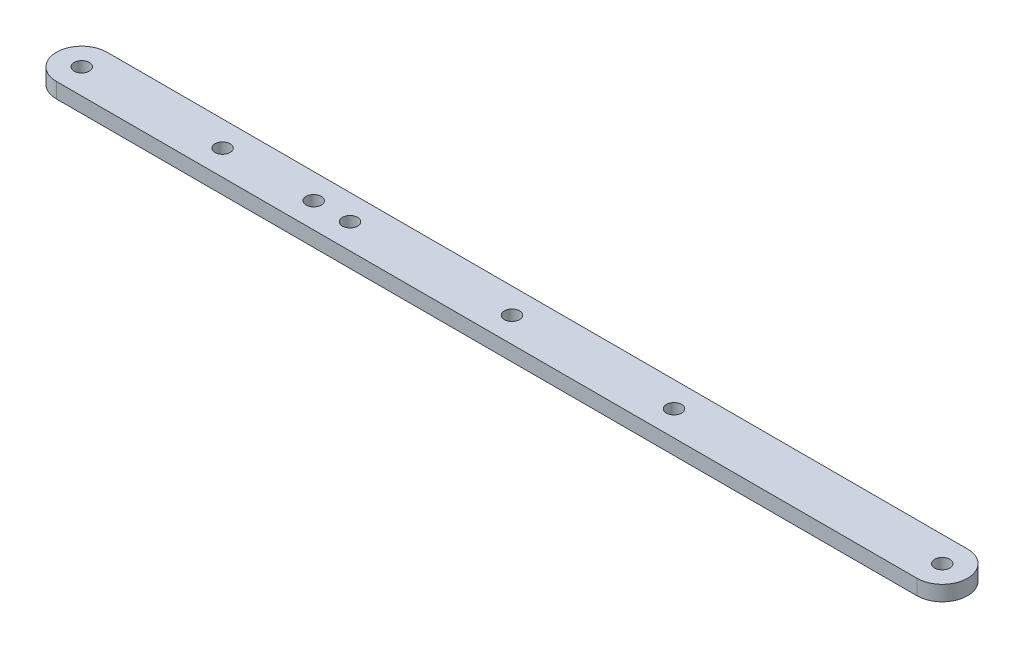
ISO-10303-21;
HEADER;
FILE_DESCRIPTION(('STEP AP214'),'2;1');
FILE_NAME('part.step','',(''),(''),'','','');
FILE_SCHEMA(('AUTOMOTIVE_DESIGN { 1 0 10303 214 1 1 1 1 }'));
ENDSEC;
DATA;
#1=APPLICATION_CONTEXT('core data for automotive mechanical design processes');
#2=APPLICATION_PROTOCOL_DEFINITION('international standard','automotive_design',2000,#1);
#3=PRODUCT_CONTEXT('',#1,'mechanical');
#4=PRODUCT('Part','Part','',(#3));
#5=PRODUCT_RELATED_PRODUCT_CATEGORY('part','',(#4));
#6=PRODUCT_DEFINITION_FORMATION('','',#4);
#7=PRODUCT_DEFINITION_CONTEXT('part definition',#1,'design');
#8=PRODUCT_DEFINITION('design','',#6,#7);
#9=PRODUCT_DEFINITION_SHAPE('','',#8);
#10=(LENGTH_UNIT() NAMED_UNIT(*) SI_UNIT(.MILLI.,.METRE.));
#11=(NAMED_UNIT(*) PLANE_ANGLE_UNIT() SI_UNIT($,.RADIAN.));
#12=(NAMED_UNIT(*) SI_UNIT($,.STERADIAN.) SOLID_ANGLE_UNIT());
#13=UNCERTAINTY_MEASURE_WITH_UNIT(LENGTH_MEASURE(1.E-05),#10,'distance_accuracy_value','');
#14=(GEOMETRIC_REPRESENTATION_CONTEXT(3) GLOBAL_UNCERTAINTY_ASSIGNED_CONTEXT((#13)) GLOBAL_UNIT_ASSIGNED_CONTEXT((#10,
#11,#12)) REPRESENTATION_CONTEXT('',''));
#15=CARTESIAN_POINT('',(0.,0.,0.));
#16=DIRECTION('',(0.,0.,1.));
#17=DIRECTION('',(1.,0.,0.));
#18=AXIS2_PLACEMENT_3D('',#15,#16,#17);
#19=CARTESIAN_POINT('',(-5.00000000000003,0.,-5.00000000000002));
#20=DIRECTION('',(0.,-1.,0.));
#21=DIRECTION('',(0.,0.,-1.));
#22=AXIS2_PLACEMENT_3D('',#19,#20,#21);
#23=CYLINDRICAL_SURFACE('',#22,5.00000000000002);
#24=DIRECTION('',(0.,-1.,0.));
#25=VECTOR('',#24,1.);
#26=CARTESIAN_POINT('',(-5.00000000000003,3.,0.));
#27=LINE('',#26,#25);
#28=CARTESIAN_POINT('',(-5.00000000000003,0.,0.));
#29=VERTEX_POINT('',#28);
#30=CARTESIAN_POINT('',(-5.00000000000003,3.,0.));
#31=VERTEX_POINT('',#30);
#32=EDGE_CURVE('E85',#29,#31,#27,.F.);
#33=ORIENTED_EDGE('',*,*,#32,.F.);
#34=CARTESIAN_POINT('',(-5.00000000000003,0.,-5.00000000000002));
#35=DIRECTION('',(0.,1.,0.));
#36=DIRECTION('',(0.,0.,1.));
#37=AXIS2_PLACEMENT_3D('',#34,#35,#36);
#38=CIRCLE('',#37,5.00000000000002);
#39=CARTESIAN_POINT('',(-5.00000000000001,0.,-10.));
#40=VERTEX_POINT('',#39);
#41=EDGE_CURVE('E43',#40,#29,#38,.F.);
#42=ORIENTED_EDGE('',*,*,#41,.F.);
#43=DIRECTION('',(0.,-1.,0.));
#44=VECTOR('',#43,1.);
#45=CARTESIAN_POINT('',(-5.00000000000003,3.,-10.));
#46=LINE('',#45,#44);
#47=CARTESIAN_POINT('',(-5.00000000000001,3.,-10.));
#48=VERTEX_POINT('',#47);
#49=EDGE_CURVE('E108',#48,#40,#46,.T.);
#50=ORIENTED_EDGE('',*,*,#49,.F.);
#51=CARTESIAN_POINT('',(-5.00000000000003,3.,-5.00000000000002));
#52=DIRECTION('',(0.,1.,0.));
#53=DIRECTION('',(0.,0.,1.));
#54=AXIS2_PLACEMENT_3D('',#51,#52,#53);
#55=CIRCLE('',#54,5.00000000000002);
#56=EDGE_CURVE('E11',#31,#48,#55,.T.);
#57=ORIENTED_EDGE('',*,*,#56,.F.);
#58=EDGE_LOOP('',(#33,#42,#50,#57));
#59=FACE_BOUND('',#58,.T.);
#60=ADVANCED_FACE('F35',(#59),#23,.T.);
#61=CARTESIAN_POINT('',(-175.,3.,-5.00000000000002));
#62=DIRECTION('',(0.,-1.,0.));
#63=DIRECTION('',(0.,0.,-1.));
#64=AXIS2_PLACEMENT_3D('',#61,#62,#63);
#65=CYLINDRICAL_SURFACE('',#64,5.);
#66=DIRECTION('',(0.,-1.,0.));
#67=VECTOR('',#66,1.);
#68=CARTESIAN_POINT('',(-175.,3.,0.));
#69=LINE('',#68,#67);
#70=CARTESIAN_POINT('',(-175.,3.,0.));
#71=VERTEX_POINT('',#70);
#72=CARTESIAN_POINT('',(-175.,0.,0.));
#73=VERTEX_POINT('',#72);
#74=EDGE_CURVE('E78',#71,#73,#69,.T.);
#75=ORIENTED_EDGE('',*,*,#74,.F.);
#76=CARTESIAN_POINT('',(-175.,3.,-5.00000000000002));
#77=DIRECTION('',(0.,1.,0.));
#78=DIRECTION('',(0.,0.,1.));
#79=AXIS2_PLACEMENT_3D('',#76,#77,#78);
#80=CIRCLE('',#79,5.);
#81=CARTESIAN_POINT('',(-175.,3.,-10.));
#82=VERTEX_POINT('',#81);
#83=EDGE_CURVE('E86',#82,#71,#80,.T.);
#84=ORIENTED_EDGE('',*,*,#83,.F.);
#85=DIRECTION('',(0.,-1.,0.));
#86=VECTOR('',#85,1.);
#87=CARTESIAN_POINT('',(-175.,3.,-10.));
#88=LINE('',#87,#86);
#89=CARTESIAN_POINT('',(-175.,0.,-10.));
#90=VERTEX_POINT('',#89);
#91=EDGE_CURVE('E81',#90,#82,#88,.F.);
#92=ORIENTED_EDGE('',*,*,#91,.F.);
#93=CARTESIAN_POINT('',(-175.,0.,-5.00000000000002));
#94=DIRECTION('',(0.,1.,0.));
#95=DIRECTION('',(0.,0.,1.));
#96=AXIS2_PLACEMENT_3D('',#93,#94,#95);
#97=CIRCLE('',#96,5.);
#98=EDGE_CURVE('E74',#73,#90,#97,.F.);
#99=ORIENTED_EDGE('',*,*,#98,.F.);
#100=EDGE_LOOP('',(#75,#84,#92,#99));
#101=FACE_BOUND('',#100,.T.);
#102=ADVANCED_FACE('F76',(#101),#65,.T.);
#103=CARTESIAN_POINT('',(0.,3.,0.));
#104=DIRECTION('',(0.,1.,0.));
#105=DIRECTION('',(0.,0.,1.));
#106=AXIS2_PLACEMENT_3D('',#103,#104,#105);
#107=PLANE('',#106);
#108=CARTESIAN_POINT('',(-147.18268,3.,-5.00000000000001));
#109=DIRECTION('',(0.,1.,0.));
#110=DIRECTION('',(0.,0.,1.));
#111=AXIS2_PLACEMENT_3D('',#108,#109,#110);
#112=CIRCLE('',#111,1.5);
#113=CARTESIAN_POINT('',(-147.18268,3.,-3.50000000000001));
#114=VERTEX_POINT('',#113);
#115=EDGE_CURVE('E151',#114,#114,#112,.T.);
#116=ORIENTED_EDGE('',*,*,#115,.F.);
#117=EDGE_LOOP('',(#116));
#118=FACE_BOUND('',#117,.T.);
#119=CARTESIAN_POINT('',(-129.18268,3.,-5.00000000000001));
#120=DIRECTION('',(0.,1.,0.));
#121=DIRECTION('',(0.,0.,-1.));
#122=AXIS2_PLACEMENT_3D('',#119,#120,#121);
#123=CIRCLE('',#122,1.5);
#124=CARTESIAN_POINT('',(-129.18268,3.,-6.50000000000001));
#125=VERTEX_POINT('',#124);
#126=EDGE_CURVE('E145',#125,#125,#123,.T.);
#127=ORIENTED_EDGE('',*,*,#126,.F.);
#128=EDGE_LOOP('',(#127));
#129=FACE_BOUND('',#128,.T.);
#130=CARTESIAN_POINT('',(-58.,3.,-5.00000000000002));
#131=DIRECTION('',(0.,1.,0.));
#132=DIRECTION('',(0.,0.,1.));
#133=AXIS2_PLACEMENT_3D('',#130,#131,#132);
#134=CIRCLE('',#133,1.5);
#135=CARTESIAN_POINT('',(-58.,3.,-3.50000000000002));
#136=VERTEX_POINT('',#135);
#137=EDGE_CURVE('E130',#136,#136,#134,.T.);
#138=ORIENTED_EDGE('',*,*,#137,.F.);
#139=EDGE_LOOP('',(#138));
#140=FACE_BOUND('',#139,.T.);
#141=CARTESIAN_POINT('',(-5.,3.,-5.));
#142=DIRECTION('',(0.,1.,0.));
#143=DIRECTION('',(0.,0.,-1.));
#144=AXIS2_PLACEMENT_3D('',#141,#142,#143);
#145=CIRCLE('',#144,1.5);
#146=CARTESIAN_POINT('',(-5.,3.,-6.5));
#147=VERTEX_POINT('',#146);
#148=EDGE_CURVE('E118',#147,#147,#145,.T.);
#149=ORIENTED_EDGE('',*,*,#148,.F.);
#150=EDGE_LOOP('',(#149));
#151=FACE_BOUND('',#150,.T.);
#152=DIRECTION('',(1.,0.,0.));
#153=VECTOR('',#152,1.);
#154=CARTESIAN_POINT('',(0.,3.,0.));
#155=LINE('',#154,#153);
#156=EDGE_CURVE('E93',#71,#31,#155,.T.);
#157=ORIENTED_EDGE('',*,*,#156,.T.);
#158=ORIENTED_EDGE('',*,*,#56,.T.);
#159=DIRECTION('',(-1.,0.,0.));
#160=VECTOR('',#159,1.);
#161=CARTESIAN_POINT('',(0.,3.,-10.));
#162=LINE('',#161,#160);
#163=EDGE_CURVE('E97',#48,#82,#162,.T.);
#164=ORIENTED_EDGE('',*,*,#163,.T.);
#165=ORIENTED_EDGE('',*,*,#83,.T.);
#166=EDGE_LOOP('',(#157,#158,#164,#165));
#167=FACE_BOUND('',#166,.T.);
#168=CARTESIAN_POINT('',(-175.,3.,-5.00000000000002));
#169=DIRECTION('',(0.,1.,0.));
#170=DIRECTION('',(0.,0.,1.));
#171=AXIS2_PLACEMENT_3D('',#168,#169,#170);
#172=CIRCLE('',#171,1.5);
#173=CARTESIAN_POINT('',(-175.,3.,-3.50000000000003));
#174=VERTEX_POINT('',#173);
#175=EDGE_CURVE('E101',#174,#174,#172,.T.);
#176=ORIENTED_EDGE('',*,*,#175,.F.);
#177=EDGE_LOOP('',(#176));
#178=FACE_BOUND('',#177,.T.);
#179=CARTESIAN_POINT('',(-90.,3.,-5.00000000000002));
#180=DIRECTION('',(0.,1.,0.));
#181=DIRECTION('',(0.,0.,1.));
#182=AXIS2_PLACEMENT_3D('',#179,#180,#181);
#183=CIRCLE('',#182,1.5);
#184=CARTESIAN_POINT('',(-90.,3.,-3.50000000000003));
#185=VERTEX_POINT('',#184);
#186=EDGE_CURVE('E124',#185,#185,#183,.T.);
#187=ORIENTED_EDGE('',*,*,#186,.F.);
#188=EDGE_LOOP('',(#187));
#189=FACE_BOUND('',#188,.T.);
#190=CARTESIAN_POINT('',(-122.,3.,-5.00000000000002));
#191=DIRECTION('',(0.,1.,0.));
#192=DIRECTION('',(0.,0.,-1.));
#193=AXIS2_PLACEMENT_3D('',#190,#191,#192);
#194=CIRCLE('',#193,1.50000000000001);
#195=CARTESIAN_POINT('',(-122.,3.,-6.50000000000003));
#196=VERTEX_POINT('',#195);
#197=EDGE_CURVE('E136',#196,#196,#194,.T.);
#198=ORIENTED_EDGE('',*,*,#197,.F.);
#199=EDGE_LOOP('',(#198));
#200=FACE_BOUND('',#199,.T.);
#201=ADVANCED_FACE('F112',(#118,#129,#140,#151,#167,#178,#189,#200),#107,.T.);
#202=CARTESIAN_POINT('',(0.,0.,0.));
#203=DIRECTION('',(0.,1.,0.));
#204=DIRECTION('',(0.,0.,1.));
#205=AXIS2_PLACEMENT_3D('',#202,#203,#204);
#206=PLANE('',#205);
#207=CARTESIAN_POINT('',(-147.18268,0.,-5.00000000000001));
#208=DIRECTION('',(0.,1.,0.));
#209=DIRECTION('',(0.,0.,1.));
#210=AXIS2_PLACEMENT_3D('',#207,#208,#209);
#211=CIRCLE('',#210,1.5);
#212=CARTESIAN_POINT('',(-147.18268,0.,-3.50000000000001));
#213=VERTEX_POINT('',#212);
#214=EDGE_CURVE('E142',#213,#213,#211,.T.);
#215=ORIENTED_EDGE('',*,*,#214,.T.);
#216=EDGE_LOOP('',(#215));
#217=FACE_BOUND('',#216,.T.);
#218=CARTESIAN_POINT('',(-129.18268,0.,-5.00000000000001));
#219=DIRECTION('',(0.,1.,0.));
#220=DIRECTION('',(0.,0.,-1.));
#221=AXIS2_PLACEMENT_3D('',#218,#219,#220);
#222=CIRCLE('',#221,1.5);
#223=CARTESIAN_POINT('',(-129.18268,0.,-6.50000000000001));
#224=VERTEX_POINT('',#223);
#225=EDGE_CURVE('E148',#224,#224,#222,.T.);
#226=ORIENTED_EDGE('',*,*,#225,.T.);
#227=EDGE_LOOP('',(#226));
#228=FACE_BOUND('',#227,.T.);
#229=DIRECTION('',(-1.,0.,0.));
#230=VECTOR('',#229,1.);
#231=CARTESIAN_POINT('',(0.,0.,-10.));
#232=LINE('',#231,#230);
#233=EDGE_CURVE('E98',#40,#90,#232,.T.);
#234=ORIENTED_EDGE('',*,*,#233,.F.);
#235=ORIENTED_EDGE('',*,*,#41,.T.);
#236=DIRECTION('',(1.,0.,0.));
#237=VECTOR('',#236,1.);
#238=CARTESIAN_POINT('',(0.,0.,0.));
#239=LINE('',#238,#237);
#240=EDGE_CURVE('E92',#73,#29,#239,.T.);
#241=ORIENTED_EDGE('',*,*,#240,.F.);
#242=ORIENTED_EDGE('',*,*,#98,.T.);
#243=EDGE_LOOP('',(#234,#235,#241,#242));
#244=FACE_BOUND('',#243,.T.);
#245=CARTESIAN_POINT('',(-175.,0.,-5.00000000000002));
#246=DIRECTION('',(0.,1.,0.));
#247=DIRECTION('',(0.,0.,1.));
#248=AXIS2_PLACEMENT_3D('',#245,#246,#247);
#249=CIRCLE('',#248,1.5);
#250=CARTESIAN_POINT('',(-175.,0.,-3.50000000000003));
#251=VERTEX_POINT('',#250);
#252=EDGE_CURVE('E115',#251,#251,#249,.T.);
#253=ORIENTED_EDGE('',*,*,#252,.T.);
#254=EDGE_LOOP('',(#253));
#255=FACE_BOUND('',#254,.T.);
#256=CARTESIAN_POINT('',(-5.,0.,-5.));
#257=DIRECTION('',(0.,1.,0.));
#258=DIRECTION('',(0.,0.,-1.));
#259=AXIS2_PLACEMENT_3D('',#256,#257,#258);
#260=CIRCLE('',#259,1.5);
#261=CARTESIAN_POINT('',(-5.,0.,-6.5));
#262=VERTEX_POINT('',#261);
#263=EDGE_CURVE('E121',#262,#262,#260,.T.);
#264=ORIENTED_EDGE('',*,*,#263,.T.);
#265=EDGE_LOOP('',(#264));
#266=FACE_BOUND('',#265,.T.);
#267=CARTESIAN_POINT('',(-90.,0.,-5.00000000000002));
#268=DIRECTION('',(0.,1.,0.));
#269=DIRECTION('',(0.,0.,1.));
#270=AXIS2_PLACEMENT_3D('',#267,#268,#269);
#271=CIRCLE('',#270,1.5);
#272=CARTESIAN_POINT('',(-90.,0.,-3.50000000000003));
#273=VERTEX_POINT('',#272);
#274=EDGE_CURVE('E127',#273,#273,#271,.T.);
#275=ORIENTED_EDGE('',*,*,#274,.T.);
#276=EDGE_LOOP('',(#275));
#277=FACE_BOUND('',#276,.T.);
#278=CARTESIAN_POINT('',(-58.,0.,-5.00000000000002));
#279=DIRECTION('',(0.,1.,0.));
#280=DIRECTION('',(0.,0.,1.));
#281=AXIS2_PLACEMENT_3D('',#278,#279,#280);
#282=CIRCLE('',#281,1.5);
#283=CARTESIAN_POINT('',(-58.,0.,-3.50000000000002));
#284=VERTEX_POINT('',#283);
#285=EDGE_CURVE('E133',#284,#284,#282,.T.);
#286=ORIENTED_EDGE('',*,*,#285,.T.);
#287=EDGE_LOOP('',(#286));
#288=FACE_BOUND('',#287,.T.);
#289=CARTESIAN_POINT('',(-122.,0.,-5.00000000000002));
#290=DIRECTION('',(0.,1.,0.));
#291=DIRECTION('',(0.,0.,-1.));
#292=AXIS2_PLACEMENT_3D('',#289,#290,#291);
#293=CIRCLE('',#292,1.50000000000001);
#294=CARTESIAN_POINT('',(-122.,0.,-6.50000000000003));
#295=VERTEX_POINT('',#294);
#296=EDGE_CURVE('E139',#295,#295,#293,.T.);
#297=ORIENTED_EDGE('',*,*,#296,.T.);
#298=EDGE_LOOP('',(#297));
#299=FACE_BOUND('',#298,.T.);
#300=ADVANCED_FACE('F95',(#217,#228,#244,#255,#266,#277,#288,#299),#206,.F.);
#301=CARTESIAN_POINT('',(0.,3.,-10.));
#302=DIRECTION('',(0.,0.,1.));
#303=DIRECTION('',(1.,0.,0.));
#304=AXIS2_PLACEMENT_3D('',#301,#302,#303);
#305=PLANE('',#304);
#306=ORIENTED_EDGE('',*,*,#163,.F.);
#307=ORIENTED_EDGE('',*,*,#49,.T.);
#308=ORIENTED_EDGE('',*,*,#233,.T.);
#309=ORIENTED_EDGE('',*,*,#91,.T.);
#310=EDGE_LOOP('',(#306,#307,#308,#309));
#311=FACE_BOUND('',#310,.T.);
#312=ADVANCED_FACE('F111',(#311),#305,.F.);
#313=CARTESIAN_POINT('',(0.,3.,0.));
#314=DIRECTION('',(0.,0.,-1.));
#315=DIRECTION('',(-1.,0.,0.));
#316=AXIS2_PLACEMENT_3D('',#313,#314,#315);
#317=PLANE('',#316);
#318=ORIENTED_EDGE('',*,*,#240,.T.);
#319=ORIENTED_EDGE('',*,*,#32,.T.);
#320=ORIENTED_EDGE('',*,*,#156,.F.);
#321=ORIENTED_EDGE('',*,*,#74,.T.);
#322=EDGE_LOOP('',(#318,#319,#320,#321));
#323=FACE_BOUND('',#322,.T.);
#324=ADVANCED_FACE('F90',(#323),#317,.F.);
#325=CARTESIAN_POINT('',(-175.,3.,-5.00000000000002));
#326=DIRECTION('',(0.,-1.,0.));
#327=DIRECTION('',(0.,0.,-1.));
#328=AXIS2_PLACEMENT_3D('',#325,#326,#327);
#329=CYLINDRICAL_SURFACE('',#328,1.5);
#330=ORIENTED_EDGE('',*,*,#175,.T.);
#331=EDGE_LOOP('',(#330));
#332=FACE_BOUND('',#331,.T.);
#333=ORIENTED_EDGE('',*,*,#252,.F.);
#334=EDGE_LOOP('',(#333));
#335=FACE_BOUND('',#334,.T.);
#336=ADVANCED_FACE('F179',(#332,#335),#329,.F.);
#337=CARTESIAN_POINT('',(-5.,3.,-5.));
#338=DIRECTION('',(0.,-1.,0.));
#339=DIRECTION('',(0.,0.,-1.));
#340=AXIS2_PLACEMENT_3D('',#337,#338,#339);
#341=CYLINDRICAL_SURFACE('',#340,1.5);
#342=ORIENTED_EDGE('',*,*,#148,.T.);
#343=EDGE_LOOP('',(#342));
#344=FACE_BOUND('',#343,.T.);
#345=ORIENTED_EDGE('',*,*,#263,.F.);
#346=EDGE_LOOP('',(#345));
#347=FACE_BOUND('',#346,.T.);
#348=ADVANCED_FACE('F175',(#344,#347),#341,.F.);
#349=CARTESIAN_POINT('',(-90.,3.,-5.00000000000002));
#350=DIRECTION('',(0.,-1.,0.));
#351=DIRECTION('',(0.,0.,-1.));
#352=AXIS2_PLACEMENT_3D('',#349,#350,#351);
#353=CYLINDRICAL_SURFACE('',#352,1.5);
#354=ORIENTED_EDGE('',*,*,#186,.T.);
#355=EDGE_LOOP('',(#354));
#356=FACE_BOUND('',#355,.T.);
#357=ORIENTED_EDGE('',*,*,#274,.F.);
#358=EDGE_LOOP('',(#357));
#359=FACE_BOUND('',#358,.T.);
#360=ADVANCED_FACE('F178',(#356,#359),#353,.F.);
#361=CARTESIAN_POINT('',(-58.,3.,-5.00000000000002));
#362=DIRECTION('',(0.,-1.,0.));
#363=DIRECTION('',(0.,0.,-1.));
#364=AXIS2_PLACEMENT_3D('',#361,#362,#363);
#365=CYLINDRICAL_SURFACE('',#364,1.5);
#366=ORIENTED_EDGE('',*,*,#137,.T.);
#367=EDGE_LOOP('',(#366));
#368=FACE_BOUND('',#367,.T.);
#369=ORIENTED_EDGE('',*,*,#285,.F.);
#370=EDGE_LOOP('',(#369));
#371=FACE_BOUND('',#370,.T.);
#372=ADVANCED_FACE('F194',(#368,#371),#365,.F.);
#373=CARTESIAN_POINT('',(-122.,3.,-5.00000000000002));
#374=DIRECTION('',(0.,-1.,0.));
#375=DIRECTION('',(0.,0.,-1.));
#376=AXIS2_PLACEMENT_3D('',#373,#374,#375);
#377=CYLINDRICAL_SURFACE('',#376,1.50000000000001);
#378=ORIENTED_EDGE('',*,*,#197,.T.);
#379=EDGE_LOOP('',(#378));
#380=FACE_BOUND('',#379,.T.);
#381=ORIENTED_EDGE('',*,*,#296,.F.);
#382=EDGE_LOOP('',(#381));
#383=FACE_BOUND('',#382,.T.);
#384=ADVANCED_FACE('F192',(#380,#383),#377,.F.);
#385=CARTESIAN_POINT('',(-129.18268,0.,-5.00000000000001));
#386=DIRECTION('',(0.,1.,0.));
#387=DIRECTION('',(0.,0.,1.));
#388=AXIS2_PLACEMENT_3D('',#385,#386,#387);
#389=CYLINDRICAL_SURFACE('',#388,1.5);
#390=ORIENTED_EDGE('',*,*,#225,.F.);
#391=EDGE_LOOP('',(#390));
#392=FACE_BOUND('',#391,.T.);
#393=ORIENTED_EDGE('',*,*,#126,.T.);
#394=EDGE_LOOP('',(#393));
#395=FACE_BOUND('',#394,.T.);
#396=ADVANCED_FACE('F162',(#392,#395),#389,.F.);
#397=CARTESIAN_POINT('',(-147.18268,0.,-5.00000000000001));
#398=DIRECTION('',(0.,1.,0.));
#399=DIRECTION('',(0.,0.,1.));
#400=AXIS2_PLACEMENT_3D('',#397,#398,#399);
#401=CYLINDRICAL_SURFACE('',#400,1.5);
#402=ORIENTED_EDGE('',*,*,#214,.F.);
#403=EDGE_LOOP('',(#402));
#404=FACE_BOUND('',#403,.T.);
#405=ORIENTED_EDGE('',*,*,#115,.T.);
#406=EDGE_LOOP('',(#405));
#407=FACE_BOUND('',#406,.T.);
#408=ADVANCED_FACE('F159',(#404,#407),#401,.F.);
#409=CLOSED_SHELL('',(#60,#102,#201,#300,#312,#324,#336,#348,#360,#372,#384,#396,#408));
#410=MANIFOLD_SOLID_BREP('B2',#409);
#411=ADVANCED_BREP_SHAPE_REPRESENTATION('',(#18,#410),#14);
#412=SHAPE_DEFINITION_REPRESENTATION(#9,#411);
ENDSEC;
END-ISO-10303-21;
